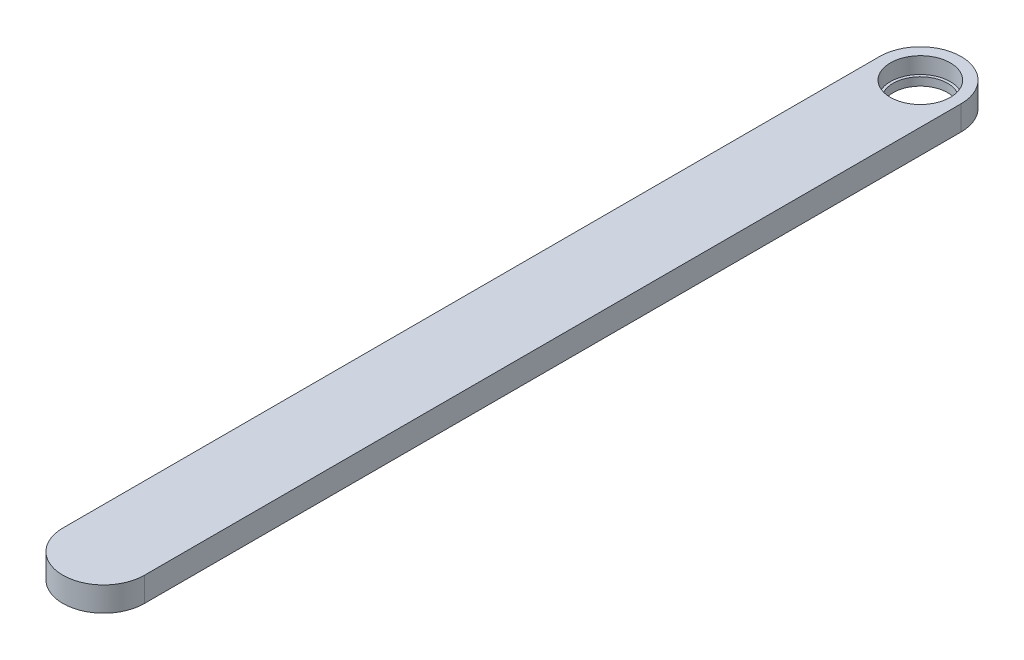
ISO-10303-21;
HEADER;
FILE_DESCRIPTION(('STEP AP214'),'2;1');
FILE_NAME('part.step','',(''),(''),'','','');
FILE_SCHEMA(('AUTOMOTIVE_DESIGN { 1 0 10303 214 1 1 1 1 }'));
ENDSEC;
DATA;
#1=APPLICATION_CONTEXT('core data for automotive mechanical design processes');
#2=APPLICATION_PROTOCOL_DEFINITION('international standard','automotive_design',2000,#1);
#3=PRODUCT_CONTEXT('',#1,'mechanical');
#4=PRODUCT('Part','Part','',(#3));
#5=PRODUCT_RELATED_PRODUCT_CATEGORY('part','',(#4));
#6=PRODUCT_DEFINITION_FORMATION('','',#4);
#7=PRODUCT_DEFINITION_CONTEXT('part definition',#1,'design');
#8=PRODUCT_DEFINITION('design','',#6,#7);
#9=PRODUCT_DEFINITION_SHAPE('','',#8);
#10=(LENGTH_UNIT() NAMED_UNIT(*) SI_UNIT(.MILLI.,.METRE.));
#11=(NAMED_UNIT(*) PLANE_ANGLE_UNIT() SI_UNIT($,.RADIAN.));
#12=(NAMED_UNIT(*) SI_UNIT($,.STERADIAN.) SOLID_ANGLE_UNIT());
#13=UNCERTAINTY_MEASURE_WITH_UNIT(LENGTH_MEASURE(1.E-05),#10,'distance_accuracy_value','');
#14=(GEOMETRIC_REPRESENTATION_CONTEXT(3) GLOBAL_UNCERTAINTY_ASSIGNED_CONTEXT((#13)) GLOBAL_UNIT_ASSIGNED_CONTEXT((#10,
#11,#12)) REPRESENTATION_CONTEXT('',''));
#15=CARTESIAN_POINT('',(0.,0.,0.));
#16=DIRECTION('',(0.,0.,1.));
#17=DIRECTION('',(1.,0.,0.));
#18=AXIS2_PLACEMENT_3D('',#15,#16,#17);
#19=CARTESIAN_POINT('',(0.,9.,0.));
#20=DIRECTION('',(0.,-1.,0.));
#21=DIRECTION('',(0.,0.,-1.));
#22=AXIS2_PLACEMENT_3D('',#19,#20,#21);
#23=CYLINDRICAL_SURFACE('',#22,15.);
#24=CARTESIAN_POINT('',(0.,0.,0.));
#25=DIRECTION('',(0.,1.,0.));
#26=DIRECTION('',(0.,0.,1.));
#27=AXIS2_PLACEMENT_3D('',#24,#25,#26);
#28=CIRCLE('',#27,15.);
#29=CARTESIAN_POINT('',(15.,0.,0.));
#30=VERTEX_POINT('',#29);
#31=CARTESIAN_POINT('',(-15.,0.,0.));
#32=VERTEX_POINT('',#31);
#33=EDGE_CURVE('E96',#30,#32,#28,.T.);
#34=ORIENTED_EDGE('',*,*,#33,.T.);
#35=DIRECTION('',(0.,-1.,0.));
#36=VECTOR('',#35,1.);
#37=CARTESIAN_POINT('',(-15.,9.,0.));
#38=LINE('',#37,#36);
#39=CARTESIAN_POINT('',(-15.,9.,0.));
#40=VERTEX_POINT('',#39);
#41=EDGE_CURVE('E11',#40,#32,#38,.T.);
#42=ORIENTED_EDGE('',*,*,#41,.F.);
#43=CARTESIAN_POINT('',(0.,9.,0.));
#44=DIRECTION('',(0.,1.,0.));
#45=DIRECTION('',(0.,0.,1.));
#46=AXIS2_PLACEMENT_3D('',#43,#44,#45);
#47=CIRCLE('',#46,15.);
#48=CARTESIAN_POINT('',(15.,9.,0.));
#49=VERTEX_POINT('',#48);
#50=EDGE_CURVE('E84',#49,#40,#47,.T.);
#51=ORIENTED_EDGE('',*,*,#50,.F.);
#52=DIRECTION('',(0.,-1.,0.));
#53=VECTOR('',#52,1.);
#54=CARTESIAN_POINT('',(15.,9.,0.));
#55=LINE('',#54,#53);
#56=EDGE_CURVE('E92',#49,#30,#55,.T.);
#57=ORIENTED_EDGE('',*,*,#56,.T.);
#58=EDGE_LOOP('',(#34,#42,#51,#57));
#59=FACE_BOUND('',#58,.T.);
#60=ADVANCED_FACE('F33',(#59),#23,.T.);
#61=CARTESIAN_POINT('',(-15.,9.,0.));
#62=DIRECTION('',(1.,0.,0.));
#63=DIRECTION('',(0.,0.,-1.));
#64=AXIS2_PLACEMENT_3D('',#61,#62,#63);
#65=PLANE('',#64);
#66=DIRECTION('',(0.,0.,1.));
#67=VECTOR('',#66,1.);
#68=CARTESIAN_POINT('',(-15.,0.,0.));
#69=LINE('',#68,#67);
#70=CARTESIAN_POINT('',(-15.,0.,300.));
#71=VERTEX_POINT('',#70);
#72=EDGE_CURVE('E88',#32,#71,#69,.T.);
#73=ORIENTED_EDGE('',*,*,#72,.T.);
#74=DIRECTION('',(0.,-1.,0.));
#75=VECTOR('',#74,1.);
#76=CARTESIAN_POINT('',(-15.,9.,300.));
#77=LINE('',#76,#75);
#78=CARTESIAN_POINT('',(-15.,9.,300.));
#79=VERTEX_POINT('',#78);
#80=EDGE_CURVE('E41',#79,#71,#77,.T.);
#81=ORIENTED_EDGE('',*,*,#80,.F.);
#82=DIRECTION('',(0.,0.,1.));
#83=VECTOR('',#82,1.);
#84=CARTESIAN_POINT('',(-15.,9.,0.));
#85=LINE('',#84,#83);
#86=EDGE_CURVE('E79',#40,#79,#85,.T.);
#87=ORIENTED_EDGE('',*,*,#86,.F.);
#88=ORIENTED_EDGE('',*,*,#41,.T.);
#89=EDGE_LOOP('',(#73,#81,#87,#88));
#90=FACE_BOUND('',#89,.T.);
#91=ADVANCED_FACE('F87',(#90),#65,.F.);
#92=CARTESIAN_POINT('',(0.,9.,300.));
#93=DIRECTION('',(0.,-1.,0.));
#94=DIRECTION('',(0.,0.,-1.));
#95=AXIS2_PLACEMENT_3D('',#92,#93,#94);
#96=CYLINDRICAL_SURFACE('',#95,15.);
#97=CARTESIAN_POINT('',(0.,0.,300.));
#98=DIRECTION('',(0.,1.,0.));
#99=DIRECTION('',(0.,0.,1.));
#100=AXIS2_PLACEMENT_3D('',#97,#98,#99);
#101=CIRCLE('',#100,15.);
#102=CARTESIAN_POINT('',(15.,0.,300.));
#103=VERTEX_POINT('',#102);
#104=EDGE_CURVE('E66',#71,#103,#101,.T.);
#105=ORIENTED_EDGE('',*,*,#104,.T.);
#106=DIRECTION('',(0.,-1.,0.));
#107=VECTOR('',#106,1.);
#108=CARTESIAN_POINT('',(15.,9.,300.));
#109=LINE('',#108,#107);
#110=CARTESIAN_POINT('',(15.,9.,300.));
#111=VERTEX_POINT('',#110);
#112=EDGE_CURVE('E89',#111,#103,#109,.T.);
#113=ORIENTED_EDGE('',*,*,#112,.F.);
#114=CARTESIAN_POINT('',(0.,9.,300.));
#115=DIRECTION('',(0.,1.,0.));
#116=DIRECTION('',(0.,0.,1.));
#117=AXIS2_PLACEMENT_3D('',#114,#115,#116);
#118=CIRCLE('',#117,15.);
#119=EDGE_CURVE('E82',#79,#111,#118,.T.);
#120=ORIENTED_EDGE('',*,*,#119,.F.);
#121=ORIENTED_EDGE('',*,*,#80,.T.);
#122=EDGE_LOOP('',(#105,#113,#120,#121));
#123=FACE_BOUND('',#122,.T.);
#124=ADVANCED_FACE('F90',(#123),#96,.T.);
#125=CARTESIAN_POINT('',(15.,9.,0.));
#126=DIRECTION('',(-1.,0.,0.));
#127=DIRECTION('',(0.,0.,1.));
#128=AXIS2_PLACEMENT_3D('',#125,#126,#127);
#129=PLANE('',#128);
#130=DIRECTION('',(0.,0.,-1.));
#131=VECTOR('',#130,1.);
#132=CARTESIAN_POINT('',(15.,0.,0.));
#133=LINE('',#132,#131);
#134=EDGE_CURVE('E72',#103,#30,#133,.T.);
#135=ORIENTED_EDGE('',*,*,#134,.T.);
#136=ORIENTED_EDGE('',*,*,#56,.F.);
#137=DIRECTION('',(0.,0.,-1.));
#138=VECTOR('',#137,1.);
#139=CARTESIAN_POINT('',(15.,9.,0.));
#140=LINE('',#139,#138);
#141=EDGE_CURVE('E49',#111,#49,#140,.T.);
#142=ORIENTED_EDGE('',*,*,#141,.F.);
#143=ORIENTED_EDGE('',*,*,#112,.T.);
#144=EDGE_LOOP('',(#135,#136,#142,#143));
#145=FACE_BOUND('',#144,.T.);
#146=ADVANCED_FACE('F104',(#145),#129,.F.);
#147=CARTESIAN_POINT('',(0.,9.,0.));
#148=DIRECTION('',(0.,1.,0.));
#149=DIRECTION('',(0.,0.,1.));
#150=AXIS2_PLACEMENT_3D('',#147,#148,#149);
#151=PLANE('',#150);
#152=CARTESIAN_POINT('',(0.,9.,0.));
#153=DIRECTION('',(0.,1.,0.));
#154=DIRECTION('',(0.,0.,1.));
#155=AXIS2_PLACEMENT_3D('',#152,#153,#154);
#156=CIRCLE('',#155,11.);
#157=CARTESIAN_POINT('',(0.,9.,11.));
#158=VERTEX_POINT('',#157);
#159=EDGE_CURVE('E110',#158,#158,#156,.T.);
#160=ORIENTED_EDGE('',*,*,#159,.F.);
#161=EDGE_LOOP('',(#160));
#162=FACE_BOUND('',#161,.T.);
#163=ORIENTED_EDGE('',*,*,#50,.T.);
#164=ORIENTED_EDGE('',*,*,#86,.T.);
#165=ORIENTED_EDGE('',*,*,#119,.T.);
#166=ORIENTED_EDGE('',*,*,#141,.T.);
#167=EDGE_LOOP('',(#163,#164,#165,#166));
#168=FACE_BOUND('',#167,.T.);
#169=ADVANCED_FACE('F80',(#162,#168),#151,.T.);
#170=CARTESIAN_POINT('',(0.,0.,0.));
#171=DIRECTION('',(0.,1.,0.));
#172=DIRECTION('',(0.,0.,1.));
#173=AXIS2_PLACEMENT_3D('',#170,#171,#172);
#174=PLANE('',#173);
#175=CARTESIAN_POINT('',(0.,0.,0.));
#176=DIRECTION('',(0.,1.,0.));
#177=DIRECTION('',(0.,0.,1.));
#178=AXIS2_PLACEMENT_3D('',#175,#176,#177);
#179=CIRCLE('',#178,10.);
#180=CARTESIAN_POINT('',(0.,0.,10.));
#181=VERTEX_POINT('',#180);
#182=EDGE_CURVE('E113',#181,#181,#179,.T.);
#183=ORIENTED_EDGE('',*,*,#182,.T.);
#184=EDGE_LOOP('',(#183));
#185=FACE_BOUND('',#184,.T.);
#186=ORIENTED_EDGE('',*,*,#33,.F.);
#187=ORIENTED_EDGE('',*,*,#134,.F.);
#188=ORIENTED_EDGE('',*,*,#104,.F.);
#189=ORIENTED_EDGE('',*,*,#72,.F.);
#190=EDGE_LOOP('',(#186,#187,#188,#189));
#191=FACE_BOUND('',#190,.T.);
#192=ADVANCED_FACE('F107',(#185,#191),#174,.F.);
#193=CARTESIAN_POINT('',(0.,3.,0.));
#194=DIRECTION('',(0.,1.,0.));
#195=DIRECTION('',(0.,0.,1.));
#196=AXIS2_PLACEMENT_3D('',#193,#194,#195);
#197=CYLINDRICAL_SURFACE('',#196,11.);
#198=CARTESIAN_POINT('',(0.,3.,0.));
#199=DIRECTION('',(0.,1.,0.));
#200=DIRECTION('',(0.,0.,1.));
#201=AXIS2_PLACEMENT_3D('',#198,#199,#200);
#202=CIRCLE('',#201,11.);
#203=CARTESIAN_POINT('',(0.,3.,11.));
#204=VERTEX_POINT('',#203);
#205=EDGE_CURVE('E99',#204,#204,#202,.T.);
#206=ORIENTED_EDGE('',*,*,#205,.F.);
#207=EDGE_LOOP('',(#206));
#208=FACE_BOUND('',#207,.T.);
#209=ORIENTED_EDGE('',*,*,#159,.T.);
#210=EDGE_LOOP('',(#209));
#211=FACE_BOUND('',#210,.T.);
#212=ADVANCED_FACE('F132',(#208,#211),#197,.F.);
#213=CARTESIAN_POINT('',(0.,3.,0.));
#214=DIRECTION('',(0.,1.,0.));
#215=DIRECTION('',(0.,0.,1.));
#216=AXIS2_PLACEMENT_3D('',#213,#214,#215);
#217=PLANE('',#216);
#218=CARTESIAN_POINT('',(0.,3.,0.));
#219=DIRECTION('',(0.,1.,0.));
#220=DIRECTION('',(0.,0.,1.));
#221=AXIS2_PLACEMENT_3D('',#218,#219,#220);
#222=CIRCLE('',#221,10.);
#223=CARTESIAN_POINT('',(0.,3.,10.));
#224=VERTEX_POINT('',#223);
#225=EDGE_CURVE('E116',#224,#224,#222,.T.);
#226=ORIENTED_EDGE('',*,*,#225,.F.);
#227=EDGE_LOOP('',(#226));
#228=FACE_BOUND('',#227,.T.);
#229=ORIENTED_EDGE('',*,*,#205,.T.);
#230=EDGE_LOOP('',(#229));
#231=FACE_BOUND('',#230,.T.);
#232=ADVANCED_FACE('F126',(#228,#231),#217,.T.);
#233=CARTESIAN_POINT('',(0.,0.,0.));
#234=DIRECTION('',(0.,1.,0.));
#235=DIRECTION('',(0.,0.,1.));
#236=AXIS2_PLACEMENT_3D('',#233,#234,#235);
#237=CYLINDRICAL_SURFACE('',#236,10.);
#238=ORIENTED_EDGE('',*,*,#182,.F.);
#239=EDGE_LOOP('',(#238));
#240=FACE_BOUND('',#239,.T.);
#241=ORIENTED_EDGE('',*,*,#225,.T.);
#242=EDGE_LOOP('',(#241));
#243=FACE_BOUND('',#242,.T.);
#244=ADVANCED_FACE('F123',(#240,#243),#237,.F.);
#245=CLOSED_SHELL('',(#60,#91,#124,#146,#169,#192,#212,#232,#244));
#246=MANIFOLD_SOLID_BREP('B2',#245);
#247=ADVANCED_BREP_SHAPE_REPRESENTATION('',(#18,#246),#14);
#248=SHAPE_DEFINITION_REPRESENTATION(#9,#247);
ENDSEC;
END-ISO-10303-21;
